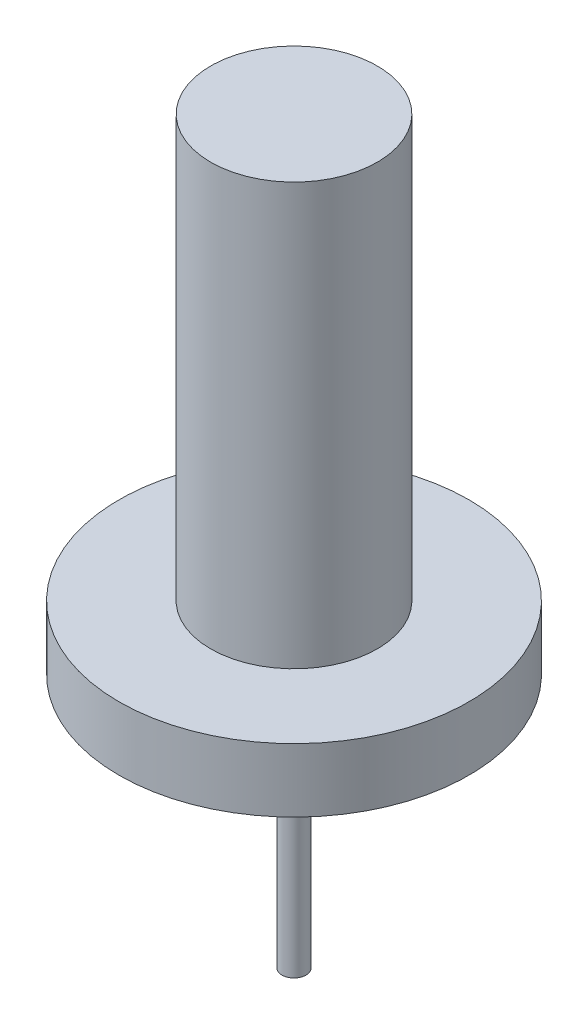
ISO-10303-21;
HEADER;
FILE_DESCRIPTION(('STEP AP214'),'2;1');
FILE_NAME('part.step','',(''),(''),'','','');
FILE_SCHEMA(('AUTOMOTIVE_DESIGN { 1 0 10303 214 1 1 1 1 }'));
ENDSEC;
DATA;
#1=APPLICATION_CONTEXT('core data for automotive mechanical design processes');
#2=APPLICATION_PROTOCOL_DEFINITION('international standard','automotive_design',2000,#1);
#3=PRODUCT_CONTEXT('',#1,'mechanical');
#4=PRODUCT('Part','Part','',(#3));
#5=PRODUCT_RELATED_PRODUCT_CATEGORY('part','',(#4));
#6=PRODUCT_DEFINITION_FORMATION('','',#4);
#7=PRODUCT_DEFINITION_CONTEXT('part definition',#1,'design');
#8=PRODUCT_DEFINITION('design','',#6,#7);
#9=PRODUCT_DEFINITION_SHAPE('','',#8);
#10=(LENGTH_UNIT() NAMED_UNIT(*) SI_UNIT(.MILLI.,.METRE.));
#11=(NAMED_UNIT(*) PLANE_ANGLE_UNIT() SI_UNIT($,.RADIAN.));
#12=(NAMED_UNIT(*) SI_UNIT($,.STERADIAN.) SOLID_ANGLE_UNIT());
#13=UNCERTAINTY_MEASURE_WITH_UNIT(LENGTH_MEASURE(1.E-05),#10,'distance_accuracy_value','');
#14=(GEOMETRIC_REPRESENTATION_CONTEXT(3) GLOBAL_UNCERTAINTY_ASSIGNED_CONTEXT((#13)) GLOBAL_UNIT_ASSIGNED_CONTEXT((#10,
#11,#12)) REPRESENTATION_CONTEXT('',''));
#15=CARTESIAN_POINT('',(0.,0.,0.));
#16=DIRECTION('',(0.,0.,1.));
#17=DIRECTION('',(1.,0.,0.));
#18=AXIS2_PLACEMENT_3D('',#15,#16,#17);
#19=CARTESIAN_POINT('',(0.,0.,0.));
#20=DIRECTION('',(0.,1.,0.));
#21=DIRECTION('',(0.,0.,1.));
#22=AXIS2_PLACEMENT_3D('',#19,#20,#21);
#23=PLANE('',#22);
#24=CARTESIAN_POINT('',(0.,0.,0.));
#25=DIRECTION('',(0.,1.,0.));
#26=DIRECTION('',(0.,0.,1.));
#27=AXIS2_PLACEMENT_3D('',#24,#25,#26);
#28=CIRCLE('',#27,34.925);
#29=CARTESIAN_POINT('',(0.,0.,34.925));
#30=VERTEX_POINT('',#29);
#31=EDGE_CURVE('E41',#30,#30,#28,.T.);
#32=ORIENTED_EDGE('',*,*,#31,.F.);
#33=EDGE_LOOP('',(#32));
#34=FACE_BOUND('',#33,.T.);
#35=CARTESIAN_POINT('',(0.,0.,0.));
#36=DIRECTION('',(0.,1.,0.));
#37=DIRECTION('',(0.,0.,1.));
#38=AXIS2_PLACEMENT_3D('',#35,#36,#37);
#39=CIRCLE('',#38,2.40792342956727);
#40=CARTESIAN_POINT('',(0.,0.,2.40792342956727));
#41=VERTEX_POINT('',#40);
#42=EDGE_CURVE('E10',#41,#41,#39,.F.);
#43=ORIENTED_EDGE('',*,*,#42,.F.);
#44=EDGE_LOOP('',(#43));
#45=FACE_BOUND('',#44,.T.);
#46=ADVANCED_FACE('F30',(#34,#45),#23,.F.);
#47=CARTESIAN_POINT('',(0.,12.7,0.));
#48=DIRECTION('',(0.,1.,0.));
#49=DIRECTION('',(0.,0.,1.));
#50=AXIS2_PLACEMENT_3D('',#47,#48,#49);
#51=PLANE('',#50);
#52=CARTESIAN_POINT('',(0.,12.7,0.));
#53=DIRECTION('',(0.,1.,0.));
#54=DIRECTION('',(0.,0.,1.));
#55=AXIS2_PLACEMENT_3D('',#52,#53,#54);
#56=CIRCLE('',#55,34.925);
#57=CARTESIAN_POINT('',(0.,12.7,34.925));
#58=VERTEX_POINT('',#57);
#59=EDGE_CURVE('E37',#58,#58,#56,.T.);
#60=ORIENTED_EDGE('',*,*,#59,.T.);
#61=EDGE_LOOP('',(#60));
#62=FACE_BOUND('',#61,.T.);
#63=CARTESIAN_POINT('',(0.,12.7,0.));
#64=DIRECTION('',(0.,1.,0.));
#65=DIRECTION('',(0.,0.,1.));
#66=AXIS2_PLACEMENT_3D('',#63,#64,#65);
#67=CIRCLE('',#66,16.637);
#68=CARTESIAN_POINT('',(0.,12.7,16.637));
#69=VERTEX_POINT('',#68);
#70=EDGE_CURVE('E48',#69,#69,#67,.T.);
#71=ORIENTED_EDGE('',*,*,#70,.F.);
#72=EDGE_LOOP('',(#71));
#73=FACE_BOUND('',#72,.T.);
#74=ADVANCED_FACE('F72',(#62,#73),#51,.T.);
#75=CARTESIAN_POINT('',(0.,12.7,0.));
#76=DIRECTION('',(0.,-1.,0.));
#77=DIRECTION('',(0.,0.,-1.));
#78=AXIS2_PLACEMENT_3D('',#75,#76,#77);
#79=CYLINDRICAL_SURFACE('',#78,34.925);
#80=ORIENTED_EDGE('',*,*,#59,.F.);
#81=EDGE_LOOP('',(#80));
#82=FACE_BOUND('',#81,.T.);
#83=ORIENTED_EDGE('',*,*,#31,.T.);
#84=EDGE_LOOP('',(#83));
#85=FACE_BOUND('',#84,.T.);
#86=ADVANCED_FACE('F32',(#82,#85),#79,.T.);
#87=CARTESIAN_POINT('',(0.,96.8248,0.));
#88=DIRECTION('',(0.,-1.,0.));
#89=DIRECTION('',(0.,0.,-1.));
#90=AXIS2_PLACEMENT_3D('',#87,#88,#89);
#91=CYLINDRICAL_SURFACE('',#90,16.637);
#92=CARTESIAN_POINT('',(0.,96.8248,0.));
#93=DIRECTION('',(0.,1.,0.));
#94=DIRECTION('',(0.,0.,1.));
#95=AXIS2_PLACEMENT_3D('',#92,#93,#94);
#96=CIRCLE('',#95,16.637);
#97=CARTESIAN_POINT('',(0.,96.8248,16.637));
#98=VERTEX_POINT('',#97);
#99=EDGE_CURVE('E46',#98,#98,#96,.T.);
#100=ORIENTED_EDGE('',*,*,#99,.F.);
#101=EDGE_LOOP('',(#100));
#102=FACE_BOUND('',#101,.T.);
#103=ORIENTED_EDGE('',*,*,#70,.T.);
#104=EDGE_LOOP('',(#103));
#105=FACE_BOUND('',#104,.T.);
#106=ADVANCED_FACE('F68',(#102,#105),#91,.T.);
#107=CARTESIAN_POINT('',(0.,96.8248,0.));
#108=DIRECTION('',(0.,1.,0.));
#109=DIRECTION('',(0.,0.,1.));
#110=AXIS2_PLACEMENT_3D('',#107,#108,#109);
#111=PLANE('',#110);
#112=ORIENTED_EDGE('',*,*,#99,.T.);
#113=EDGE_LOOP('',(#112));
#114=FACE_BOUND('',#113,.T.);
#115=ADVANCED_FACE('F61',(#114),#111,.T.);
#116=CARTESIAN_POINT('',(0.,-50.8,0.));
#117=DIRECTION('',(0.,1.,0.));
#118=DIRECTION('',(0.,0.,1.));
#119=AXIS2_PLACEMENT_3D('',#116,#117,#118);
#120=CYLINDRICAL_SURFACE('',#119,2.40792342956727);
#121=CARTESIAN_POINT('',(0.,-50.8,0.));
#122=DIRECTION('',(0.,-1.,0.));
#123=DIRECTION('',(0.,0.,-1.));
#124=AXIS2_PLACEMENT_3D('',#121,#122,#123);
#125=CIRCLE('',#124,2.40792342956727);
#126=CARTESIAN_POINT('',(0.,-50.8,-2.40792342956727));
#127=VERTEX_POINT('',#126);
#128=EDGE_CURVE('E51',#127,#127,#125,.T.);
#129=ORIENTED_EDGE('',*,*,#128,.F.);
#130=EDGE_LOOP('',(#129));
#131=FACE_BOUND('',#130,.T.);
#132=ORIENTED_EDGE('',*,*,#42,.T.);
#133=EDGE_LOOP('',(#132));
#134=FACE_BOUND('',#133,.T.);
#135=ADVANCED_FACE('F59',(#131,#134),#120,.T.);
#136=CARTESIAN_POINT('',(0.,-50.8,0.));
#137=DIRECTION('',(0.,-1.,0.));
#138=DIRECTION('',(0.,0.,-1.));
#139=AXIS2_PLACEMENT_3D('',#136,#137,#138);
#140=PLANE('',#139);
#141=ORIENTED_EDGE('',*,*,#128,.T.);
#142=EDGE_LOOP('',(#141));
#143=FACE_BOUND('',#142,.T.);
#144=ADVANCED_FACE('F57',(#143),#140,.T.);
#145=CLOSED_SHELL('',(#46,#74,#86,#106,#115,#135,#144));
#146=MANIFOLD_SOLID_BREP('B2',#145);
#147=ADVANCED_BREP_SHAPE_REPRESENTATION('',(#18,#146),#14);
#148=SHAPE_DEFINITION_REPRESENTATION(#9,#147);
ENDSEC;
END-ISO-10303-21;
